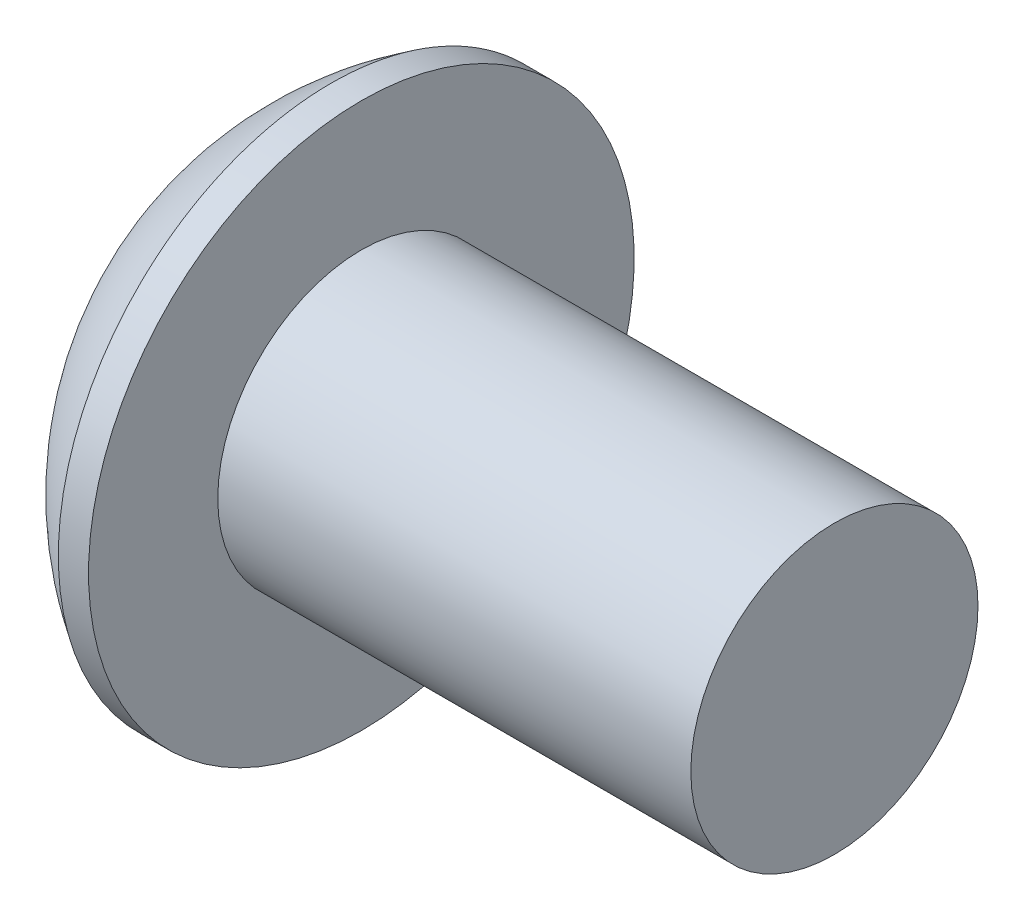
ISO-10303-21;
HEADER;
FILE_DESCRIPTION(('STEP AP214'),'2;1');
FILE_NAME('part.step','',(''),(''),'','','');
FILE_SCHEMA(('AUTOMOTIVE_DESIGN { 1 0 10303 214 1 1 1 1 }'));
ENDSEC;
DATA;
#1=APPLICATION_CONTEXT('core data for automotive mechanical design processes');
#2=APPLICATION_PROTOCOL_DEFINITION('international standard','automotive_design',2000,#1);
#3=PRODUCT_CONTEXT('',#1,'mechanical');
#4=PRODUCT('Part','Part','',(#3));
#5=PRODUCT_RELATED_PRODUCT_CATEGORY('part','',(#4));
#6=PRODUCT_DEFINITION_FORMATION('','',#4);
#7=PRODUCT_DEFINITION_CONTEXT('part definition',#1,'design');
#8=PRODUCT_DEFINITION('design','',#6,#7);
#9=PRODUCT_DEFINITION_SHAPE('','',#8);
#10=(LENGTH_UNIT() NAMED_UNIT(*) SI_UNIT(.MILLI.,.METRE.));
#11=(NAMED_UNIT(*) PLANE_ANGLE_UNIT() SI_UNIT($,.RADIAN.));
#12=(NAMED_UNIT(*) SI_UNIT($,.STERADIAN.) SOLID_ANGLE_UNIT());
#13=UNCERTAINTY_MEASURE_WITH_UNIT(LENGTH_MEASURE(1.E-05),#10,'distance_accuracy_value','');
#14=(GEOMETRIC_REPRESENTATION_CONTEXT(3) GLOBAL_UNCERTAINTY_ASSIGNED_CONTEXT((#13)) GLOBAL_UNIT_ASSIGNED_CONTEXT((#10,
#11,#12)) REPRESENTATION_CONTEXT('',''));
#15=CARTESIAN_POINT('',(0.,0.,0.));
#16=DIRECTION('',(0.,0.,1.));
#17=DIRECTION('',(1.,0.,0.));
#18=AXIS2_PLACEMENT_3D('',#15,#16,#17);
#19=CARTESIAN_POINT('',(-0.533400000000002,0.,0.));
#20=DIRECTION('',(-1.,0.,0.));
#21=DIRECTION('',(0.,0.,1.));
#22=AXIS2_PLACEMENT_3D('',#19,#20,#21);
#23=PLANE('',#22);
#24=DIRECTION('',(0.,0.5,0.866025403784439));
#25=VECTOR('',#24,1.);
#26=CARTESIAN_POINT('',(-0.533400000000002,1.83308710467706,0.));
#27=LINE('',#26,#25);
#28=CARTESIAN_POINT('',(-0.533400000000002,1.83308710467706,0.));
#29=VERTEX_POINT('',#28);
#30=CARTESIAN_POINT('',(-0.533400000000002,0.916543552338531,-1.5875));
#31=VERTEX_POINT('',#30);
#32=EDGE_CURVE('E115',#29,#31,#27,.F.);
#33=ORIENTED_EDGE('',*,*,#32,.T.);
#34=DIRECTION('',(0.,1.,0.));
#35=VECTOR('',#34,1.);
#36=CARTESIAN_POINT('',(-0.533400000000002,0.916543552338531,-1.5875));
#37=LINE('',#36,#35);
#38=CARTESIAN_POINT('',(-0.533400000000002,-0.916543552338531,-1.5875));
#39=VERTEX_POINT('',#38);
#40=EDGE_CURVE('E82',#31,#39,#37,.F.);
#41=ORIENTED_EDGE('',*,*,#40,.T.);
#42=DIRECTION('',(0.,0.5,-0.866025403784439));
#43=VECTOR('',#42,1.);
#44=CARTESIAN_POINT('',(-0.533400000000002,-0.916543552338531,-1.5875));
#45=LINE('',#44,#43);
#46=CARTESIAN_POINT('',(-0.533400000000002,-1.83308710467706,0.));
#47=VERTEX_POINT('',#46);
#48=EDGE_CURVE('E84',#39,#47,#45,.F.);
#49=ORIENTED_EDGE('',*,*,#48,.T.);
#50=DIRECTION('',(0.,-0.5,-0.866025403784439));
#51=VECTOR('',#50,1.);
#52=CARTESIAN_POINT('',(-0.533400000000002,-1.83308710467706,0.));
#53=LINE('',#52,#51);
#54=CARTESIAN_POINT('',(-0.533400000000002,-0.916543552338533,1.5875));
#55=VERTEX_POINT('',#54);
#56=EDGE_CURVE('E85',#47,#55,#53,.F.);
#57=ORIENTED_EDGE('',*,*,#56,.T.);
#58=DIRECTION('',(0.,-1.,0.));
#59=VECTOR('',#58,1.);
#60=CARTESIAN_POINT('',(-0.533400000000002,-0.916543552338532,1.5875));
#61=LINE('',#60,#59);
#62=CARTESIAN_POINT('',(-0.533400000000002,0.916543552338531,1.5875));
#63=VERTEX_POINT('',#62);
#64=EDGE_CURVE('E71',#55,#63,#61,.F.);
#65=ORIENTED_EDGE('',*,*,#64,.T.);
#66=DIRECTION('',(0.,-0.5,0.866025403784439));
#67=VECTOR('',#66,1.);
#68=CARTESIAN_POINT('',(-0.533400000000002,0.916543552338531,1.5875));
#69=LINE('',#68,#67);
#70=EDGE_CURVE('E110',#63,#29,#69,.F.);
#71=ORIENTED_EDGE('',*,*,#70,.T.);
#72=EDGE_LOOP('',(#33,#41,#49,#57,#65,#71));
#73=FACE_BOUND('',#72,.T.);
#74=ADVANCED_FACE('F17',(#73),#23,.T.);
#75=CARTESIAN_POINT('',(-0.533400000000002,-1.83308710467706,0.));
#76=DIRECTION('',(0.,-0.866025403784439,0.5));
#77=DIRECTION('',(0.,-0.5,-0.866025403784439));
#78=AXIS2_PLACEMENT_3D('',#75,#76,#77);
#79=PLANE('',#78);
#80=CARTESIAN_POINT('',(-2.56539999994394,-1.8330871046745,-2.00804498786736E-11));
#81=CARTESIAN_POINT('',(-2.53392818229741,-1.80158505518366,0.0545631502562923));
#82=CARTESIAN_POINT('',(-2.5043050627177,-1.76955629074211,0.110038597579172));
#83=CARTESIAN_POINT('',(-2.45006639539122,-1.70424635317817,0.223158727683824));
#84=CARTESIAN_POINT('',(-2.42548101615987,-1.6709589724711,0.280814162317604));
#85=CARTESIAN_POINT('',(-2.38336609605347,-1.60383660211837,0.397073518091736));
#86=CARTESIAN_POINT('',(-2.36573072948629,-1.57001869730198,0.455647847439699));
#87=CARTESIAN_POINT('',(-2.33856008862263,-1.50163859306838,0.574085662199493));
#88=CARTESIAN_POINT('',(-2.32900454007239,-1.46707848106388,0.633945532106421));
#89=CARTESIAN_POINT('',(-2.32038274183869,-1.40751253669323,0.737116774157155));
#90=CARTESIAN_POINT('',(-2.31910682172836,-1.38258360390154,0.780294952330845));
#91=CARTESIAN_POINT('',(-2.32125913780735,-1.33276652395073,0.866580665890379));
#92=CARTESIAN_POINT('',(-2.32468902284537,-1.30787839414808,0.90968817121394));
#93=CARTESIAN_POINT('',(-2.33605631415915,-1.25834345643267,0.995485200086784));
#94=CARTESIAN_POINT('',(-2.34399762019329,-1.23369687609494,1.03817432946455));
#95=CARTESIAN_POINT('',(-2.36395627681902,-1.18481740842653,1.12283605091316));
#96=CARTESIAN_POINT('',(-2.37597537628367,-1.16058470328902,1.16480832741616));
#97=CARTESIAN_POINT('',(-2.41164383187845,-1.09853862948576,1.27227527965358));
#98=CARTESIAN_POINT('',(-2.43797770752625,-1.06110942924036,1.33710455616529));
#99=CARTESIAN_POINT('',(-2.48243061452926,-1.00607390269188,1.43242888436855));
#100=CARTESIAN_POINT('',(-2.49804835924321,-0.987937988038022,1.46384120999077));
#101=CARTESIAN_POINT('',(-2.53070945051393,-0.951999508520197,1.52608848246242));
#102=CARTESIAN_POINT('',(-2.54775211871235,-0.934196789917587,1.55692369559499));
#103=CARTESIAN_POINT('',(-2.56539999993807,-0.916543552329633,1.58750000001541));
#104=B_SPLINE_CURVE_WITH_KNOTS('',3,(#80,#81,#82,#83,#84,#85,#86,#87,#88,#89,#90,#91,#92,#93,
#94,#95,#96,#97,#98,#99,#100,#101,#102,#103),.UNSPECIFIED.,.F.,.F.,(4,2,2,2,2,2,2,2,2,2,2,4),
(0.,0.211427927732169,0.424087197148228,0.633370156422424,0.842126401515785,0.991537201098734,
1.14100036552056,1.29059292577265,1.44024972414947,1.67781721417335,1.79627069411587,
1.91466809995991),.UNSPECIFIED.);
#105=CARTESIAN_POINT('',(-2.56539999993857,-1.83308710468646,0.));
#106=VERTEX_POINT('',#105);
#107=CARTESIAN_POINT('',(-2.56539999993106,-0.916543552342318,1.5875));
#108=VERTEX_POINT('',#107);
#109=EDGE_CURVE('E20',#106,#108,#104,.T.);
#110=ORIENTED_EDGE('',*,*,#109,.T.);
#111=DIRECTION('',(1.,0.,0.));
#112=VECTOR('',#111,1.);
#113=CARTESIAN_POINT('',(-0.533400000000002,-0.916543552338533,1.5875));
#114=LINE('',#113,#112);
#115=EDGE_CURVE('E90',#108,#55,#114,.T.);
#116=ORIENTED_EDGE('',*,*,#115,.T.);
#117=ORIENTED_EDGE('',*,*,#56,.F.);
#118=DIRECTION('',(1.,0.,0.));
#119=VECTOR('',#118,1.);
#120=CARTESIAN_POINT('',(-0.533400000000002,-1.83308710467706,0.));
#121=LINE('',#120,#119);
#122=EDGE_CURVE('E58',#47,#106,#121,.F.);
#123=ORIENTED_EDGE('',*,*,#122,.T.);
#124=EDGE_LOOP('',(#110,#116,#117,#123));
#125=FACE_BOUND('',#124,.T.);
#126=ADVANCED_FACE('F89',(#125),#79,.F.);
#127=CARTESIAN_POINT('',(-0.533400000000002,-0.916543552338531,-1.5875));
#128=DIRECTION('',(0.,-0.866025403784439,-0.5));
#129=DIRECTION('',(0.,0.5,-0.866025403784439));
#130=AXIS2_PLACEMENT_3D('',#127,#128,#129);
#131=PLANE('',#130);
#132=CARTESIAN_POINT('',(-2.56539999994527,-0.916543552319403,-1.58750000001409));
#133=CARTESIAN_POINT('',(-2.53392818229919,-0.948045601822691,-1.53293684974403));
#134=CARTESIAN_POINT('',(-2.50430506271949,-0.980074366269487,-1.47746140242354));
#135=CARTESIAN_POINT('',(-2.45006639539264,-1.04538430383757,-1.36434127232016));
#136=CARTESIAN_POINT('',(-2.42548101616093,-1.07867168454351,-1.30668583768523));
#137=CARTESIAN_POINT('',(-2.38336609605398,-1.14579405489574,-1.19042648190974));
#138=CARTESIAN_POINT('',(-2.36573072948662,-1.17961195971273,-1.13185215256154));
#139=CARTESIAN_POINT('',(-2.3385600886227,-1.2479920639471,-1.013414337801));
#140=CARTESIAN_POINT('',(-2.32900454007237,-1.28255217595175,-0.953554467893575));
#141=CARTESIAN_POINT('',(-2.32038274183866,-1.34211812032265,-0.850383225842316));
#142=CARTESIAN_POINT('',(-2.31910682172835,-1.36704705311438,-0.807205047668587));
#143=CARTESIAN_POINT('',(-2.32125913780739,-1.41686413306525,-0.720919334108961));
#144=CARTESIAN_POINT('',(-2.32468902284544,-1.44175226286793,-0.67781182878535));
#145=CARTESIAN_POINT('',(-2.33605631415929,-1.49128720058339,-0.592014799912417));
#146=CARTESIAN_POINT('',(-2.34399762019345,-1.51593378092113,-0.54932567053461));
#147=CARTESIAN_POINT('',(-2.36395627681926,-1.56481324858959,-0.464663949085931));
#148=CARTESIAN_POINT('',(-2.37597537628395,-1.58904595372712,-0.422691672582891));
#149=CARTESIAN_POINT('',(-2.41164383187876,-1.65109202753029,-0.315224720345625));
#150=CARTESIAN_POINT('',(-2.43797770752652,-1.6885212277756,-0.250395443834082));
#151=CARTESIAN_POINT('',(-2.48243061452944,-1.74355675432393,-0.15507111563107));
#152=CARTESIAN_POINT('',(-2.49804835924337,-1.76169266897775,-0.123658790008927));
#153=CARTESIAN_POINT('',(-2.53070945051401,-1.79763114849548,-0.0614115175374324));
#154=CARTESIAN_POINT('',(-2.5477521187124,-1.81543386709805,-0.0305763044049344));
#155=CARTESIAN_POINT('',(-2.56539999993807,-1.83308710468596,1.54136844652939E-11));
#156=B_SPLINE_CURVE_WITH_KNOTS('',3,(#132,#133,#134,#135,#136,#137,#138,#139,#140,#141,#142,
#143,#144,#145,#146,#147,#148,#149,#150,#151,#152,#153,#154,#155),.UNSPECIFIED.,.F.,.F.,(4,2,2,
2,2,2,2,2,2,2,2,4),(0.,0.211427927733669,0.424087197151313,0.633370156427101,0.842126401522016,
0.99153720110513,1.14100036552713,1.29059292577937,1.44024972415633,1.67781721417961,
1.79627069412184,1.9146680999656),.UNSPECIFIED.);
#157=CARTESIAN_POINT('',(-2.56539999995198,-0.916543552351339,-1.58750000002218));
#158=VERTEX_POINT('',#157);
#159=EDGE_CURVE('E94',#158,#106,#156,.T.);
#160=ORIENTED_EDGE('',*,*,#159,.T.);
#161=ORIENTED_EDGE('',*,*,#122,.F.);
#162=ORIENTED_EDGE('',*,*,#48,.F.);
#163=DIRECTION('',(-1.,0.,0.));
#164=VECTOR('',#163,1.);
#165=CARTESIAN_POINT('',(-0.533400000000002,-0.916543552338531,-1.5875));
#166=LINE('',#165,#164);
#167=EDGE_CURVE('E96',#39,#158,#166,.T.);
#168=ORIENTED_EDGE('',*,*,#167,.T.);
#169=EDGE_LOOP('',(#160,#161,#162,#168));
#170=FACE_BOUND('',#169,.T.);
#171=ADVANCED_FACE('F92',(#170),#131,.F.);
#172=CARTESIAN_POINT('',(-0.533400000000002,0.916543552338531,-1.5875));
#173=DIRECTION('',(0.,0.,-1.));
#174=DIRECTION('',(-1.,0.,0.));
#175=AXIS2_PLACEMENT_3D('',#172,#173,#174);
#176=PLANE('',#175);
#177=CARTESIAN_POINT('',(-2.56539999994527,0.916543552360294,-1.58749999999048));
#178=CARTESIAN_POINT('',(-2.53392818229821,0.853539453376781,-1.58749999999657));
#179=CARTESIAN_POINT('',(-2.50430506271702,0.789481924500113,-1.58749999999908));
#180=CARTESIAN_POINT('',(-2.45006639538581,0.658862049392287,-1.58750000000093));
#181=CARTESIAN_POINT('',(-2.42548101615122,0.59228728799181,-1.58750000000025));
#182=CARTESIAN_POINT('',(-2.38336609603683,0.458042547310979,-1.58749999999976));
#183=CARTESIAN_POINT('',(-2.36573072946494,0.390406737689213,-1.58749999999994));
#184=CARTESIAN_POINT('',(-2.3385600885904,0.253646529243895,-1.58750000000006));
#185=CARTESIAN_POINT('',(-2.32900454003397,0.184526305245804,-1.58750000000001));
#186=CARTESIAN_POINT('',(-2.32038274178942,0.0653944165301613,-1.58749999999999));
#187=CARTESIAN_POINT('',(-2.31910682167392,0.0155365509618711,-1.5875));
#188=CARTESIAN_POINT('',(-2.3212591377409,-0.0840976089101244,-1.5875));
#189=CARTESIAN_POINT('',(-2.32468902277208,-0.133873868500894,-1.5875));
#190=CARTESIAN_POINT('',(-2.33605631407098,-0.2329437439033,-1.5875));
#191=CARTESIAN_POINT('',(-2.34399762009707,-0.282236904564879,-1.5875));
#192=CARTESIAN_POINT('',(-2.36395627670599,-0.379995839874564,-1.5875));
#193=CARTESIAN_POINT('',(-2.37597537616188,-0.428461250136325,-1.5875));
#194=CARTESIAN_POINT('',(-2.41164383175616,-0.552553397787632,-1.5875));
#195=CARTESIAN_POINT('',(-2.43797770742117,-0.627411798334259,-1.5875));
#196=CARTESIAN_POINT('',(-2.48243061445881,-0.737482851511091,-1.5875));
#197=CARTESIAN_POINT('',(-2.49804835918582,-0.773754680844889,-1.5875));
#198=CARTESIAN_POINT('',(-2.53070945048496,-0.845631639931401,-1.5875));
#199=CARTESIAN_POINT('',(-2.54775211869874,-0.881237077161412,-1.5875));
#200=CARTESIAN_POINT('',(-2.56539999994071,-0.916543552361606,-1.5875));
#201=B_SPLINE_CURVE_WITH_KNOTS('',3,(#177,#178,#179,#180,#181,#182,#183,#184,#185,#186,#187,
#188,#189,#190,#191,#192,#193,#194,#195,#196,#197,#198,#199,#200),.UNSPECIFIED.,.F.,.F.,(4,2,2,
2,2,2,2,2,2,2,2,4),(0.,0.211427927701375,0.424087197086717,0.633370156331471,0.842126401395377,
0.991537200933545,1.14100036531054,1.29059292551773,1.44024972384963,1.677817214047,
1.79627069407681,1.91466810000777),.UNSPECIFIED.);
#202=CARTESIAN_POINT('',(-2.56539999995198,0.916543552337129,-1.58749999999757));
#203=VERTEX_POINT('',#202);
#204=EDGE_CURVE('E198',#203,#158,#201,.T.);
#205=ORIENTED_EDGE('',*,*,#204,.T.);
#206=ORIENTED_EDGE('',*,*,#167,.F.);
#207=ORIENTED_EDGE('',*,*,#40,.F.);
#208=DIRECTION('',(1.,0.,0.));
#209=VECTOR('',#208,1.);
#210=CARTESIAN_POINT('',(-0.533400000000002,0.916543552338531,-1.5875));
#211=LINE('',#210,#209);
#212=EDGE_CURVE('E112',#31,#203,#211,.F.);
#213=ORIENTED_EDGE('',*,*,#212,.T.);
#214=EDGE_LOOP('',(#205,#206,#207,#213));
#215=FACE_BOUND('',#214,.T.);
#216=ADVANCED_FACE('F188',(#215),#176,.F.);
#217=CARTESIAN_POINT('',(-0.533400000000002,1.83308710467706,0.));
#218=DIRECTION('',(0.,0.866025403784439,-0.5));
#219=DIRECTION('',(0.,0.5,0.866025403784439));
#220=AXIS2_PLACEMENT_3D('',#217,#218,#219);
#221=PLANE('',#220);
#222=CARTESIAN_POINT('',(-2.56539999994394,1.8330871046745,2.00800374309997E-11));
#223=CARTESIAN_POINT('',(-2.5339281822974,1.80158505518366,-0.0545631502562965));
#224=CARTESIAN_POINT('',(-2.5043050627177,1.76955629074211,-0.11003859757918));
#225=CARTESIAN_POINT('',(-2.45006639539121,1.70424635317816,-0.22315872768384));
#226=CARTESIAN_POINT('',(-2.42548101615987,1.67095897247109,-0.280814162317626));
#227=CARTESIAN_POINT('',(-2.38336609605347,1.60383660211835,-0.397073518091758));
#228=CARTESIAN_POINT('',(-2.36573072948628,1.57001869730197,-0.455647847439717));
#229=CARTESIAN_POINT('',(-2.33856008862263,1.50163859306837,-0.574085662199503));
#230=CARTESIAN_POINT('',(-2.32900454007239,1.46707848106388,-0.633945532106426));
#231=CARTESIAN_POINT('',(-2.32038274183869,1.40751253669322,-0.737116774157154));
#232=CARTESIAN_POINT('',(-2.31910682172836,1.38258360390154,-0.780294952330843));
#233=CARTESIAN_POINT('',(-2.32125913780735,1.33276652395073,-0.866580665890374));
#234=CARTESIAN_POINT('',(-2.32468902284537,1.30787839414808,-0.909688171213933));
#235=CARTESIAN_POINT('',(-2.33605631415915,1.25834345643267,-0.995485200086777));
#236=CARTESIAN_POINT('',(-2.34399762019328,1.23369687609495,-1.03817432946455));
#237=CARTESIAN_POINT('',(-2.36395627681902,1.18481740842653,-1.12283605091316));
#238=CARTESIAN_POINT('',(-2.37597537628367,1.16058470328902,-1.16480832741616));
#239=CARTESIAN_POINT('',(-2.41164383187872,1.09853862948529,-1.2722752796544));
#240=CARTESIAN_POINT('',(-2.43797770752691,1.06110942923942,-1.33710455616691));
#241=CARTESIAN_POINT('',(-2.48243061453059,1.00607390269029,-1.43242888437131));
#242=CARTESIAN_POINT('',(-2.49804835924479,0.987937988036214,-1.4638412099939));
#243=CARTESIAN_POINT('',(-2.53070945051602,0.951999508517968,-1.52608848246628));
#244=CARTESIAN_POINT('',(-2.54775211871471,0.934196789915152,-1.55692369559921));
#245=CARTESIAN_POINT('',(-2.56539999994071,0.916543552326994,-1.58750000001998));
#246=B_SPLINE_CURVE_WITH_KNOTS('',3,(#222,#223,#224,#225,#226,#227,#228,#229,#230,#231,#232,
#233,#234,#235,#236,#237,#238,#239,#240,#241,#242,#243,#244,#245),.UNSPECIFIED.,.F.,.F.,(4,2,2,
2,2,2,2,2,2,2,2,4),(0.,0.211427927732185,0.424087197148259,0.63337015642244,0.842126401515786,
0.99153720109873,1.14100036552055,1.29059292577265,1.44024972414947,1.67781721417631,
1.7962706941203,1.9146680999658),.UNSPECIFIED.);
#247=CARTESIAN_POINT('',(-2.56539999993857,1.83308710468646,0.));
#248=VERTEX_POINT('',#247);
#249=EDGE_CURVE('E192',#248,#203,#246,.T.);
#250=ORIENTED_EDGE('',*,*,#249,.T.);
#251=ORIENTED_EDGE('',*,*,#212,.F.);
#252=ORIENTED_EDGE('',*,*,#32,.F.);
#253=DIRECTION('',(1.,0.,0.));
#254=VECTOR('',#253,1.);
#255=CARTESIAN_POINT('',(-0.533400000000002,1.83308710467706,0.));
#256=LINE('',#255,#254);
#257=EDGE_CURVE('E107',#29,#248,#256,.F.);
#258=ORIENTED_EDGE('',*,*,#257,.T.);
#259=EDGE_LOOP('',(#250,#251,#252,#258));
#260=FACE_BOUND('',#259,.T.);
#261=ADVANCED_FACE('F184',(#260),#221,.F.);
#262=CARTESIAN_POINT('',(-0.533400000000002,0.916543552338531,1.5875));
#263=DIRECTION('',(0.,0.866025403784439,0.5));
#264=DIRECTION('',(0.,-0.5,0.866025403784439));
#265=AXIS2_PLACEMENT_3D('',#262,#263,#264);
#266=PLANE('',#265);
#267=CARTESIAN_POINT('',(-2.56539999994394,0.91654355231986,1.58750000000782));
#268=CARTESIAN_POINT('',(-2.53392818229741,0.948045601824288,1.5329368497393));
#269=CARTESIAN_POINT('',(-2.5043050627177,0.980074366271431,1.47746140241964));
#270=CARTESIAN_POINT('',(-2.45006639539122,1.04538430383949,1.36434127231737));
#271=CARTESIAN_POINT('',(-2.42548101615987,1.07867168454504,1.30668583768271));
#272=CARTESIAN_POINT('',(-2.38336609605347,1.14579405489669,1.19042648190795));
#273=CARTESIAN_POINT('',(-2.36573072948629,1.17961195971347,1.13185215256022));
#274=CARTESIAN_POINT('',(-2.33856008862263,1.24799206394736,1.01341433780059));
#275=CARTESIAN_POINT('',(-2.32900454007239,1.28255217595174,0.953554467893597));
#276=CARTESIAN_POINT('',(-2.32038274183869,1.34211812032234,0.850383225842832));
#277=CARTESIAN_POINT('',(-2.31910682172836,1.36704705311405,0.807205047669152));
#278=CARTESIAN_POINT('',(-2.32125913780735,1.41686413306487,0.720919334109624));
#279=CARTESIAN_POINT('',(-2.32468902284537,1.44175226286752,0.677811828786061));
#280=CARTESIAN_POINT('',(-2.33605631415915,1.49128720058292,0.592014799913215));
#281=CARTESIAN_POINT('',(-2.34399762019328,1.51593378092065,0.549325670535446));
#282=CARTESIAN_POINT('',(-2.36395627681902,1.56481324858906,0.464663949086841));
#283=CARTESIAN_POINT('',(-2.37597537628367,1.58904595372657,0.422691672583837));
#284=CARTESIAN_POINT('',(-2.41164383187845,1.65109202752983,0.315224720346425));
#285=CARTESIAN_POINT('',(-2.43797770752625,1.68852122777524,0.250395443834706));
#286=CARTESIAN_POINT('',(-2.48243061452926,1.74355675432371,0.155071115631445));
#287=CARTESIAN_POINT('',(-2.49804835924321,1.76169266897757,0.123658790009225));
#288=CARTESIAN_POINT('',(-2.53070945051393,1.7976311484954,0.0614115175375789));
#289=CARTESIAN_POINT('',(-2.54775211871235,1.81543386709801,0.0305763044050067));
#290=CARTESIAN_POINT('',(-2.56539999993807,1.83308710468596,-1.54142580803093E-11));
#291=B_SPLINE_CURVE_WITH_KNOTS('',3,(#267,#268,#269,#270,#271,#272,#273,#274,#275,#276,#277,
#278,#279,#280,#281,#282,#283,#284,#285,#286,#287,#288,#289,#290),.UNSPECIFIED.,.F.,.F.,(4,2,2,
2,2,2,2,2,2,2,2,4),(0.,0.211427927732169,0.424087197148227,0.633370156422423,0.842126401515785,
0.991537201098733,1.14100036552056,1.29059292577265,1.44024972414946,1.67781721417335,
1.79627069411587,1.91466809995991),.UNSPECIFIED.);
#292=CARTESIAN_POINT('',(-2.56539999993857,0.91654355234323,1.58750000000814));
#293=VERTEX_POINT('',#292);
#294=EDGE_CURVE('E166',#293,#248,#291,.T.);
#295=ORIENTED_EDGE('',*,*,#294,.T.);
#296=ORIENTED_EDGE('',*,*,#257,.F.);
#297=ORIENTED_EDGE('',*,*,#70,.F.);
#298=DIRECTION('',(1.,0.,0.));
#299=VECTOR('',#298,1.);
#300=CARTESIAN_POINT('',(-0.533400000000002,0.916543552338531,1.5875));
#301=LINE('',#300,#299);
#302=EDGE_CURVE('E39',#63,#293,#301,.F.);
#303=ORIENTED_EDGE('',*,*,#302,.T.);
#304=EDGE_LOOP('',(#295,#296,#297,#303));
#305=FACE_BOUND('',#304,.T.);
#306=ADVANCED_FACE('F177',(#305),#266,.F.);
#307=CARTESIAN_POINT('',(-0.533400000000002,-0.916543552338532,1.5875));
#308=DIRECTION('',(0.,0.,1.));
#309=DIRECTION('',(0.,-1.,0.));
#310=AXIS2_PLACEMENT_3D('',#307,#308,#309);
#311=PLANE('',#310);
#312=CARTESIAN_POINT('',(-2.56539999994394,-0.916543552354642,1.58749999998774));
#313=CARTESIAN_POINT('',(-2.53392818229741,-0.853539453359365,1.58749999999559));
#314=CARTESIAN_POINT('',(-2.50430506271771,-0.789481924470656,1.58749999999882));
#315=CARTESIAN_POINT('',(-2.45006639539122,-0.658862049338629,1.58750000000119));
#316=CARTESIAN_POINT('',(-2.42548101615988,-0.592287287925995,1.58750000000032));
#317=CARTESIAN_POINT('',(-2.38336609605349,-0.458042547221593,1.58749999999969));
#318=CARTESIAN_POINT('',(-2.36573072948631,-0.390406737588416,1.58749999999992));
#319=CARTESIAN_POINT('',(-2.33856008862266,-0.253646529120892,1.58750000000008));
#320=CARTESIAN_POINT('',(-2.32900454007243,-0.184526305112002,1.58750000000002));
#321=CARTESIAN_POINT('',(-2.32038274183874,-0.065394416370719,1.58749999999999));
#322=CARTESIAN_POINT('',(-2.31910682172841,-0.0155365507873145,1.5875));
#323=CARTESIAN_POINT('',(-2.32125913780742,0.0840976091143436,1.5875));
#324=CARTESIAN_POINT('',(-2.32468902284545,0.133873868719661,1.5875));
#325=CARTESIAN_POINT('',(-2.33605631415924,0.232943744150505,1.5875));
#326=CARTESIAN_POINT('',(-2.34399762019338,0.282236904825971,1.5875));
#327=CARTESIAN_POINT('',(-2.36395627681913,0.379995840162817,1.5875));
#328=CARTESIAN_POINT('',(-2.37597537628379,0.428461250437852,1.5875));
#329=CARTESIAN_POINT('',(-2.41164383187857,0.552553398044325,1.5875));
#330=CARTESIAN_POINT('',(-2.43797770752636,0.627411798535089,1.5875));
#331=CARTESIAN_POINT('',(-2.48243061452933,0.737482851631955,1.5875));
#332=CARTESIAN_POINT('',(-2.49804835924327,0.773754680939651,1.5875));
#333=CARTESIAN_POINT('',(-2.53070945051396,0.84563163997525,1.5875));
#334=CARTESIAN_POINT('',(-2.54775211871237,0.881237077180446,1.5875));
#335=CARTESIAN_POINT('',(-2.56539999993807,0.91654355235633,1.5875));
#336=B_SPLINE_CURVE_WITH_KNOTS('',3,(#312,#313,#314,#315,#316,#317,#318,#319,#320,#321,#322,
#323,#324,#325,#326,#327,#328,#329,#330,#331,#332,#333,#334,#335),.UNSPECIFIED.,.F.,.F.,(4,2,2,
2,2,2,2,2,2,2,2,4),(0.,0.211427927732202,0.424087197148294,0.633370156422521,0.842126401515914,
0.991537201098908,1.14100036552078,1.29059292577292,1.44024972414978,1.67781721417349,
1.79627069411592,1.91466809995988),.UNSPECIFIED.);
#337=EDGE_CURVE('E158',#108,#293,#336,.T.);
#338=ORIENTED_EDGE('',*,*,#337,.T.);
#339=ORIENTED_EDGE('',*,*,#302,.F.);
#340=ORIENTED_EDGE('',*,*,#64,.F.);
#341=ORIENTED_EDGE('',*,*,#115,.F.);
#342=EDGE_LOOP('',(#338,#339,#340,#341));
#343=FACE_BOUND('',#342,.T.);
#344=ADVANCED_FACE('F173',(#343),#311,.F.);
#345=CARTESIAN_POINT('',(-2.56540000003724,0.,0.));
#346=DIRECTION('',(-1.,0.,0.));
#347=DIRECTION('',(0.,-1.,0.));
#348=AXIS2_PLACEMENT_3D('',#345,#346,#347);
#349=CONICAL_SURFACE('',#348,1.83308710478514,0.78539816351237);
#350=ORIENTED_EDGE('',*,*,#109,.F.);
#351=CARTESIAN_POINT('',(-2.56539999992356,0.,0.));
#352=DIRECTION('',(-1.,0.,0.));
#353=DIRECTION('',(0.,-1.,0.));
#354=AXIS2_PLACEMENT_3D('',#351,#352,#353);
#355=CIRCLE('',#354,1.83308710467145);
#356=EDGE_CURVE('E165',#108,#106,#355,.F.);
#357=ORIENTED_EDGE('',*,*,#356,.F.);
#358=EDGE_LOOP('',(#350,#357));
#359=FACE_BOUND('',#358,.T.);
#360=ADVANCED_FACE('F176',(#359),#349,.F.);
#361=CARTESIAN_POINT('',(-2.56540000003724,0.,0.));
#362=DIRECTION('',(-1.,0.,0.));
#363=DIRECTION('',(0.,-1.,0.));
#364=AXIS2_PLACEMENT_3D('',#361,#362,#363);
#365=CONICAL_SURFACE('',#364,1.83308710478514,0.78539816351237);
#366=ORIENTED_EDGE('',*,*,#159,.F.);
#367=CARTESIAN_POINT('',(-2.56539999992356,0.,0.));
#368=DIRECTION('',(-1.,0.,0.));
#369=DIRECTION('',(0.,-1.,0.));
#370=AXIS2_PLACEMENT_3D('',#367,#368,#369);
#371=CIRCLE('',#370,1.83308710467145);
#372=EDGE_CURVE('E272',#106,#158,#371,.F.);
#373=ORIENTED_EDGE('',*,*,#372,.F.);
#374=EDGE_LOOP('',(#366,#373));
#375=FACE_BOUND('',#374,.T.);
#376=ADVANCED_FACE('F210',(#375),#365,.F.);
#377=CARTESIAN_POINT('',(-2.56540000003724,0.,0.));
#378=DIRECTION('',(-1.,0.,0.));
#379=DIRECTION('',(0.,-1.,0.));
#380=AXIS2_PLACEMENT_3D('',#377,#378,#379);
#381=CONICAL_SURFACE('',#380,1.83308710478514,0.785398163397448);
#382=ORIENTED_EDGE('',*,*,#204,.F.);
#383=CARTESIAN_POINT('',(-2.5653999999804,0.,0.));
#384=DIRECTION('',(-1.,0.,0.));
#385=DIRECTION('',(0.,-1.,0.));
#386=AXIS2_PLACEMENT_3D('',#383,#384,#385);
#387=CIRCLE('',#386,1.83308710472829);
#388=EDGE_CURVE('E269',#158,#203,#387,.F.);
#389=ORIENTED_EDGE('',*,*,#388,.F.);
#390=EDGE_LOOP('',(#382,#389));
#391=FACE_BOUND('',#390,.T.);
#392=ADVANCED_FACE('F206',(#391),#381,.F.);
#393=CARTESIAN_POINT('',(-2.56540000003724,0.,0.));
#394=DIRECTION('',(-1.,0.,0.));
#395=DIRECTION('',(0.,-1.,0.));
#396=AXIS2_PLACEMENT_3D('',#393,#394,#395);
#397=CONICAL_SURFACE('',#396,1.83308710478514,0.78539816351237);
#398=ORIENTED_EDGE('',*,*,#249,.F.);
#399=CARTESIAN_POINT('',(-2.56539999992356,0.,0.));
#400=DIRECTION('',(-1.,0.,0.));
#401=DIRECTION('',(0.,-1.,0.));
#402=AXIS2_PLACEMENT_3D('',#399,#400,#401);
#403=CIRCLE('',#402,1.83308710467145);
#404=EDGE_CURVE('E266',#203,#248,#403,.F.);
#405=ORIENTED_EDGE('',*,*,#404,.F.);
#406=EDGE_LOOP('',(#398,#405));
#407=FACE_BOUND('',#406,.T.);
#408=ADVANCED_FACE('F203',(#407),#397,.F.);
#409=CARTESIAN_POINT('',(-2.56540000003724,0.,0.));
#410=DIRECTION('',(-1.,0.,0.));
#411=DIRECTION('',(0.,-1.,0.));
#412=AXIS2_PLACEMENT_3D('',#409,#410,#411);
#413=CONICAL_SURFACE('',#412,1.83308710478514,0.78539816351237);
#414=ORIENTED_EDGE('',*,*,#294,.F.);
#415=CARTESIAN_POINT('',(-2.56539999992356,0.,0.));
#416=DIRECTION('',(-1.,0.,0.));
#417=DIRECTION('',(0.,-1.,0.));
#418=AXIS2_PLACEMENT_3D('',#415,#416,#417);
#419=CIRCLE('',#418,1.83308710467145);
#420=EDGE_CURVE('E261',#248,#293,#419,.F.);
#421=ORIENTED_EDGE('',*,*,#420,.F.);
#422=EDGE_LOOP('',(#414,#421));
#423=FACE_BOUND('',#422,.T.);
#424=ADVANCED_FACE('F153',(#423),#413,.F.);
#425=CARTESIAN_POINT('',(-2.56540000003724,0.,0.));
#426=DIRECTION('',(-1.,0.,0.));
#427=DIRECTION('',(0.,-1.,0.));
#428=AXIS2_PLACEMENT_3D('',#425,#426,#427);
#429=CONICAL_SURFACE('',#428,1.83308710478514,0.785398163512485);
#430=ORIENTED_EDGE('',*,*,#337,.F.);
#431=CARTESIAN_POINT('',(-2.56539999992356,0.,0.));
#432=DIRECTION('',(-1.,0.,0.));
#433=DIRECTION('',(0.,-1.,0.));
#434=AXIS2_PLACEMENT_3D('',#431,#432,#433);
#435=CIRCLE('',#434,1.83308710467145);
#436=EDGE_CURVE('E138',#293,#108,#435,.F.);
#437=ORIENTED_EDGE('',*,*,#436,.F.);
#438=EDGE_LOOP('',(#430,#437));
#439=FACE_BOUND('',#438,.T.);
#440=ADVANCED_FACE('F148',(#439),#429,.F.);
#441=CARTESIAN_POINT('',(-2.5654,0.,0.));
#442=DIRECTION('',(-1.,0.,0.));
#443=DIRECTION('',(0.,-1.,0.));
#444=AXIS2_PLACEMENT_3D('',#441,#442,#443);
#445=PLANE('',#444);
#446=CARTESIAN_POINT('',(-2.5654,-2.29235000000002,0.));
#447=CARTESIAN_POINT('',(-2.56540000000001,-2.29234961429958,-0.0643619991867162));
#448=CARTESIAN_POINT('',(-2.56540000000002,-2.28963695190109,-0.128735826629366));
#449=CARTESIAN_POINT('',(-2.56539999999999,-2.27880393843649,-0.257038618985287));
#450=CARTESIAN_POINT('',(-2.56539999999995,-2.27068199085128,-0.320967446929163));
#451=CARTESIAN_POINT('',(-2.56540000000006,-2.24906694794257,-0.448021254607718));
#452=CARTESIAN_POINT('',(-2.56540000000021,-2.23556532653462,-0.511144793381861));
#453=CARTESIAN_POINT('',(-2.56539999999979,-2.20328400495645,-0.636065176149322));
#454=CARTESIAN_POINT('',(-2.56539999999921,-2.18450002159115,-0.697860899533935));
#455=CARTESIAN_POINT('',(-2.56539999999869,-2.12048422735804,-0.88032980292775));
#456=CARTESIAN_POINT('',(-2.56539999999995,-2.0675359907946,-0.99839179592812));
#457=CARTESIAN_POINT('',(-2.56540000000006,-1.94254204858674,-1.22393765942148));
#458=CARTESIAN_POINT('',(-2.56539999999891,-1.87049561696644,-1.33142112758208));
#459=CARTESIAN_POINT('',(-2.56539999999932,-1.74974254194881,-1.48237719670935));
#460=CARTESIAN_POINT('',(-2.56539999999982,-1.70734573132302,-1.53101280076738));
#461=CARTESIAN_POINT('',(-2.56540000000018,-1.6186391029153,-1.62450601319185));
#462=CARTESIAN_POINT('',(-2.56540000000005,-1.57233309727313,-1.66936721890417));
#463=CARTESIAN_POINT('',(-2.56539999999995,-1.47608431707234,-1.7550488420402));
#464=CARTESIAN_POINT('',(-2.56539999999999,-1.42613990458995,-1.79586741981512));
#465=CARTESIAN_POINT('',(-2.56540000000002,-1.32299452541252,-1.87315615311523));
#466=CARTESIAN_POINT('',(-2.56540000000001,-1.26979280714188,-1.90962529930697));
#467=CARTESIAN_POINT('',(-2.56539999999999,-1.10588180153953,-2.0120772215109));
#468=CARTESIAN_POINT('',(-2.5654,-0.990764947001321,-2.07119486286667));
#469=CARTESIAN_POINT('',(-2.5654,-0.752302198839727,-2.16922858468856));
#470=CARTESIAN_POINT('',(-2.5654,-0.628956393121269,-2.2081448809145));
#471=CARTESIAN_POINT('',(-2.5654,-0.377466101733277,-2.2647275576592));
#472=CARTESIAN_POINT('',(-2.5654,-0.249321590440388,-2.28239382469379));
#473=CARTESIAN_POINT('',(-2.5654,0.0081143537161001,-2.29595665980956));
#474=CARTESIAN_POINT('',(-2.5654,0.137405786579698,-2.29185322789073));
#475=CARTESIAN_POINT('',(-2.5654,0.393449386933719,-2.2620096240906));
#476=CARTESIAN_POINT('',(-2.5654,0.520201567981077,-2.23626956775766));
#477=CARTESIAN_POINT('',(-2.5654,0.767645294384444,-2.16383549332687));
#478=CARTESIAN_POINT('',(-2.5654,0.888336774993549,-2.11714125142686));
#479=CARTESIAN_POINT('',(-2.5654,1.06210572146655,-2.03247976453654));
#480=CARTESIAN_POINT('',(-2.5654,1.11884498714066,-2.00180278323696));
#481=CARTESIAN_POINT('',(-2.5654,1.22954062855572,-1.93578011658036));
#482=CARTESIAN_POINT('',(-2.5654,1.28349764565392,-1.9004355139425));
#483=CARTESIAN_POINT('',(-2.5654,1.38821676641537,-1.82534174602348));
#484=CARTESIAN_POINT('',(-2.5654,1.43898030563028,-1.78559458231503));
#485=CARTESIAN_POINT('',(-2.5654,1.53701984534431,-1.70193996292362));
#486=CARTESIAN_POINT('',(-2.5654,1.5842924328055,-1.65802852924127));
#487=CARTESIAN_POINT('',(-2.5654,1.72023903553758,-1.52059650554139));
#488=CARTESIAN_POINT('',(-2.5654,1.80318066138239,-1.42127847626519));
#489=CARTESIAN_POINT('',(-2.5654,1.95118232345098,-1.21011519784664));
#490=CARTESIAN_POINT('',(-2.5654,2.01624303935584,-1.09827042509272));
#491=CARTESIAN_POINT('',(-2.5654,2.09907772661314,-0.923538238005839));
#492=CARTESIAN_POINT('',(-2.5654,2.12425103063558,-0.864058373981966));
#493=CARTESIAN_POINT('',(-2.5654,2.16947990046565,-0.743221562175601));
#494=CARTESIAN_POINT('',(-2.5654,2.18953960800684,-0.681866178863365));
#495=CARTESIAN_POINT('',(-2.5654,2.22438542051156,-0.557786972400356));
#496=CARTESIAN_POINT('',(-2.5654,2.23917985294818,-0.495065478128172));
#497=CARTESIAN_POINT('',(-2.5654,2.26343456384453,-0.368611258323514));
#498=CARTESIAN_POINT('',(-2.5654,2.27289641559285,-0.304878836759566));
#499=CARTESIAN_POINT('',(-2.5654,2.28388649696736,-0.200873029360621));
#500=CARTESIAN_POINT('',(-2.5654,2.28705930623293,-0.160766164180096));
#501=CARTESIAN_POINT('',(-2.5654,2.29129117827044,-0.0804410725432706));
#502=CARTESIAN_POINT('',(-2.5654,2.29235024104238,-0.0402228460869715));
#503=CARTESIAN_POINT('',(-2.56540000000001,2.29234961429956,0.0643619991867166));
#504=CARTESIAN_POINT('',(-2.56540000000002,2.28963695190107,0.128735826629366));
#505=CARTESIAN_POINT('',(-2.56539999999999,2.27880393843648,0.257038618985288));
#506=CARTESIAN_POINT('',(-2.56539999999995,2.27068199085126,0.320967446929163));
#507=CARTESIAN_POINT('',(-2.56540000000006,2.24906694794255,0.448021254607719));
#508=CARTESIAN_POINT('',(-2.56540000000021,2.2355653265346,0.511144793381862));
#509=CARTESIAN_POINT('',(-2.56539999999979,2.20328400495644,0.636065176149322));
#510=CARTESIAN_POINT('',(-2.56539999999921,2.18450002159113,0.697860899533936));
#511=CARTESIAN_POINT('',(-2.56539999999869,2.12048422735802,0.88032980292775));
#512=CARTESIAN_POINT('',(-2.56539999999995,2.06753599079459,0.998391795928119));
#513=CARTESIAN_POINT('',(-2.56540000000006,1.94254204858672,1.22393765942147));
#514=CARTESIAN_POINT('',(-2.56539999999891,1.87049561696642,1.33142112758208));
#515=CARTESIAN_POINT('',(-2.56539999999933,1.7497425419488,1.48237719670935));
#516=CARTESIAN_POINT('',(-2.56539999999982,1.707345731323,1.53101280076738));
#517=CARTESIAN_POINT('',(-2.56540000000018,1.61863910291529,1.62450601319185));
#518=CARTESIAN_POINT('',(-2.56540000000005,1.57233309727312,1.66936721890418));
#519=CARTESIAN_POINT('',(-2.56539999999995,1.47608431707233,1.75504884204021));
#520=CARTESIAN_POINT('',(-2.56539999999999,1.42613990458993,1.79586741981512));
#521=CARTESIAN_POINT('',(-2.56540000000002,1.3229945254125,1.87315615311523));
#522=CARTESIAN_POINT('',(-2.56540000000001,1.26979280714187,1.90962529930697));
#523=CARTESIAN_POINT('',(-2.56539999999999,1.10588180153952,2.0120772215109));
#524=CARTESIAN_POINT('',(-2.5654,0.990764947001304,2.07119486286667));
#525=CARTESIAN_POINT('',(-2.5654,0.75230219883971,2.16922858468856));
#526=CARTESIAN_POINT('',(-2.5654,0.628956393121252,2.2081448809145));
#527=CARTESIAN_POINT('',(-2.5654,0.377466101733262,2.2647275576592));
#528=CARTESIAN_POINT('',(-2.5654,0.249321590440372,2.28239382469379));
#529=CARTESIAN_POINT('',(-2.5654,-0.00811435371611611,2.29595665980955));
#530=CARTESIAN_POINT('',(-2.5654,-0.137405786579714,2.29185322789072));
#531=CARTESIAN_POINT('',(-2.5654,-0.393449386933735,2.2620096240906));
#532=CARTESIAN_POINT('',(-2.5654,-0.520201567981094,2.23626956775766));
#533=CARTESIAN_POINT('',(-2.5654,-0.767645294384462,2.16383549332688));
#534=CARTESIAN_POINT('',(-2.5654,-0.888336774993567,2.11714125142686));
#535=CARTESIAN_POINT('',(-2.5654,-1.06210572146657,2.03247976453654));
#536=CARTESIAN_POINT('',(-2.5654,-1.11884498714068,2.00180278323695));
#537=CARTESIAN_POINT('',(-2.5654,-1.22954062855574,1.93578011658036));
#538=CARTESIAN_POINT('',(-2.5654,-1.28349764565394,1.9004355139425));
#539=CARTESIAN_POINT('',(-2.5654,-1.38821676641539,1.82534174602348));
#540=CARTESIAN_POINT('',(-2.5654,-1.4389803056303,1.78559458231503));
#541=CARTESIAN_POINT('',(-2.5654,-1.53701984534432,1.70193996292362));
#542=CARTESIAN_POINT('',(-2.5654,-1.58429243280552,1.65802852924127));
#543=CARTESIAN_POINT('',(-2.5654,-1.7202390355376,1.52059650554139));
#544=CARTESIAN_POINT('',(-2.5654,-1.8031806613824,1.42127847626519));
#545=CARTESIAN_POINT('',(-2.5654,-1.951182323451,1.21011519784664));
#546=CARTESIAN_POINT('',(-2.5654,-2.01624303935586,1.09827042509272));
#547=CARTESIAN_POINT('',(-2.5654,-2.09907772661316,0.923538238005837));
#548=CARTESIAN_POINT('',(-2.5654,-2.1242510306356,0.864058373981964));
#549=CARTESIAN_POINT('',(-2.5654,-2.16947990046567,0.743221562175599));
#550=CARTESIAN_POINT('',(-2.5654,-2.18953960800686,0.681866178863365));
#551=CARTESIAN_POINT('',(-2.5654,-2.22438542051158,0.557786972400357));
#552=CARTESIAN_POINT('',(-2.5654,-2.2391798529482,0.495065478128172));
#553=CARTESIAN_POINT('',(-2.5654,-2.26343456384455,0.368611258323514));
#554=CARTESIAN_POINT('',(-2.5654,-2.27289641559287,0.304878836759567));
#555=CARTESIAN_POINT('',(-2.5654,-2.28388649696738,0.200873029360623));
#556=CARTESIAN_POINT('',(-2.5654,-2.28705930623295,0.160766164180096));
#557=CARTESIAN_POINT('',(-2.5654,-2.29129117827046,0.080441072543271));
#558=CARTESIAN_POINT('',(-2.5654,-2.29235024104239,0.0402228460869719));
#559=CARTESIAN_POINT('',(-2.5654,-2.29235000000002,0.));
#560=B_SPLINE_CURVE_WITH_KNOTS('',3,(#446,#447,#448,#449,#450,#451,#452,#453,#454,#455,#456,
#457,#458,#459,#460,#461,#462,#463,#464,#465,#466,#467,#468,#469,#470,#471,#472,#473,#474,#475,
#476,#477,#478,#479,#480,#481,#482,#483,#484,#485,#486,#487,#488,#489,#490,#491,#492,#493,#494,
#495,#496,#497,#498,#499,#500,#501,#502,#503,#504,#505,#506,#507,#508,#509,#510,#511,#512,#513,
#514,#515,#516,#517,#518,#519,#520,#521,#522,#523,#524,#525,#526,#527,#528,#529,#530,#531,#532,
#533,#534,#535,#536,#537,#538,#539,#540,#541,#542,#543,#544,#545,#546,#547,#548,#549,#550,#551,
#552,#553,#554,#555,#556,#557,#558,#559),.UNSPECIFIED.,.T.,.F.,(4,2,2,2,2,2,2,2,2,2,2,2,2,2,2,2,
2,2,2,2,2,2,2,2,2,2,2,2,2,2,2,2,2,2,2,2,2,2,2,2,2,2,2,2,2,2,2,2,2,2,2,2,2,2,2,2,4),(0.,
0.193048968618034,0.386154939782395,0.579568183995959,0.77313871149104,1.15935703864578,
1.54559004914645,1.73895960916369,1.93214273180064,2.12541336477222,2.31872876140889,
2.70495649282619,3.09118009906583,3.47740576789432,3.86363143672286,4.24985504296255,
4.6360827743798,4.82939817101621,5.02266880398749,5.21585192662421,5.40922148664123,
5.79545449714218,6.18167282429725,6.37524335179263,6.56865659600643,6.7617625671709,
6.9548115357891,7.07545693291923,7.19610233004938,7.38915129866742,7.58225726983178,
7.77567051404534,7.96924104154042,8.35545936869516,8.74169237919583,8.93506193921307,
9.12824506185002,9.3215156948216,9.51483109145827,9.90105882287557,10.2872824291152,
10.6735080979437,11.0597337667722,11.4459573730119,11.8321851044292,12.0255005010656,
12.2187711340369,12.4119542566736,12.6053238166906,12.9915568271916,13.3777751543466,
13.571345681842,13.7647589260558,13.9578648972203,14.1509138658385,14.2715592629686,
14.3922046600988),.UNSPECIFIED.);
#561=CARTESIAN_POINT('',(-2.5654,-2.29235000000002,0.));
#562=VERTEX_POINT('',#561);
#563=EDGE_CURVE('E131',#562,#562,#560,.T.);
#564=ORIENTED_EDGE('',*,*,#563,.F.);
#565=EDGE_LOOP('',(#564));
#566=FACE_BOUND('',#565,.T.);
#567=ORIENTED_EDGE('',*,*,#420,.T.);
#568=ORIENTED_EDGE('',*,*,#436,.T.);
#569=ORIENTED_EDGE('',*,*,#356,.T.);
#570=ORIENTED_EDGE('',*,*,#372,.T.);
#571=ORIENTED_EDGE('',*,*,#388,.T.);
#572=ORIENTED_EDGE('',*,*,#404,.T.);
#573=EDGE_LOOP('',(#567,#568,#569,#570,#571,#572));
#574=FACE_BOUND('',#573,.T.);
#575=ADVANCED_FACE('F144',(#566,#574),#445,.T.);
#576=CARTESIAN_POINT('',(2.29449606481481,0.,0.));
#577=DIRECTION('',(0.,1.,0.));
#578=DIRECTION('',(-1.,0.,0.));
#579=AXIS2_PLACEMENT_3D('',#576,#577,#578);
#580=SPHERICAL_SURFACE('',#579,5.37340285883187);
#581=ORIENTED_EDGE('',*,*,#563,.T.);
#582=EDGE_LOOP('',(#581));
#583=FACE_BOUND('',#582,.T.);
#584=CARTESIAN_POINT('',(-0.508,0.,0.));
#585=DIRECTION('',(1.,0.,0.));
#586=DIRECTION('',(0.,1.,0.));
#587=AXIS2_PLACEMENT_3D('',#584,#585,#586);
#588=CIRCLE('',#587,4.5847);
#589=CARTESIAN_POINT('',(-0.508,4.5847,0.));
#590=VERTEX_POINT('',#589);
#591=EDGE_CURVE('E128',#590,#590,#588,.T.);
#592=ORIENTED_EDGE('',*,*,#591,.F.);
#593=EDGE_LOOP('',(#592));
#594=FACE_BOUND('',#593,.T.);
#595=ADVANCED_FACE('F140',(#583,#594),#580,.T.);
#596=CARTESIAN_POINT('',(0.,0.,0.));
#597=DIRECTION('',(1.,0.,0.));
#598=DIRECTION('',(0.,1.,0.));
#599=AXIS2_PLACEMENT_3D('',#596,#597,#598);
#600=CYLINDRICAL_SURFACE('',#599,4.5847);
#601=ORIENTED_EDGE('',*,*,#591,.T.);
#602=EDGE_LOOP('',(#601));
#603=FACE_BOUND('',#602,.T.);
#604=CARTESIAN_POINT('',(0.,0.,0.));
#605=DIRECTION('',(1.,0.,0.));
#606=DIRECTION('',(0.,1.,0.));
#607=AXIS2_PLACEMENT_3D('',#604,#605,#606);
#608=CIRCLE('',#607,4.5847);
#609=CARTESIAN_POINT('',(0.,4.5847,0.));
#610=VERTEX_POINT('',#609);
#611=EDGE_CURVE('E125',#610,#610,#608,.T.);
#612=ORIENTED_EDGE('',*,*,#611,.F.);
#613=EDGE_LOOP('',(#612));
#614=FACE_BOUND('',#613,.T.);
#615=ADVANCED_FACE('F240',(#603,#614),#600,.T.);
#616=CARTESIAN_POINT('',(7.9502,0.,0.));
#617=DIRECTION('',(1.,0.,0.));
#618=DIRECTION('',(0.,1.,0.));
#619=AXIS2_PLACEMENT_3D('',#616,#617,#618);
#620=PLANE('',#619);
#621=CARTESIAN_POINT('',(7.9502,0.,0.));
#622=DIRECTION('',(-1.,0.,0.));
#623=DIRECTION('',(0.,-1.,0.));
#624=AXIS2_PLACEMENT_3D('',#621,#622,#623);
#625=CIRCLE('',#624,2.413);
#626=CARTESIAN_POINT('',(7.9502,-2.413,0.));
#627=VERTEX_POINT('',#626);
#628=EDGE_CURVE('E30',#627,#627,#625,.T.);
#629=ORIENTED_EDGE('',*,*,#628,.F.);
#630=EDGE_LOOP('',(#629));
#631=FACE_BOUND('',#630,.T.);
#632=ADVANCED_FACE('F234',(#631),#620,.T.);
#633=CARTESIAN_POINT('',(0.,4.5847,0.));
#634=DIRECTION('',(1.,0.,0.));
#635=DIRECTION('',(0.,1.,0.));
#636=AXIS2_PLACEMENT_3D('',#633,#634,#635);
#637=PLANE('',#636);
#638=CARTESIAN_POINT('',(0.,0.,0.));
#639=DIRECTION('',(-1.,0.,0.));
#640=DIRECTION('',(0.,-1.,0.));
#641=AXIS2_PLACEMENT_3D('',#638,#639,#640);
#642=CIRCLE('',#641,2.413);
#643=CARTESIAN_POINT('',(0.,-2.413,0.));
#644=VERTEX_POINT('',#643);
#645=EDGE_CURVE('E11',#644,#644,#642,.F.);
#646=ORIENTED_EDGE('',*,*,#645,.F.);
#647=EDGE_LOOP('',(#646));
#648=FACE_BOUND('',#647,.T.);
#649=ORIENTED_EDGE('',*,*,#611,.T.);
#650=EDGE_LOOP('',(#649));
#651=FACE_BOUND('',#650,.T.);
#652=ADVANCED_FACE('F228',(#648,#651),#637,.T.);
#653=CARTESIAN_POINT('',(7.9502,0.,0.));
#654=DIRECTION('',(-1.,0.,0.));
#655=DIRECTION('',(0.,-1.,0.));
#656=AXIS2_PLACEMENT_3D('',#653,#654,#655);
#657=CYLINDRICAL_SURFACE('',#656,2.413);
#658=ORIENTED_EDGE('',*,*,#628,.T.);
#659=EDGE_LOOP('',(#658));
#660=FACE_BOUND('',#659,.T.);
#661=ORIENTED_EDGE('',*,*,#645,.T.);
#662=EDGE_LOOP('',(#661));
#663=FACE_BOUND('',#662,.T.);
#664=ADVANCED_FACE('F226',(#660,#663),#657,.T.);
#665=CLOSED_SHELL('',(#74,#126,#171,#216,#261,#306,#344,#360,#376,#392,#408,#424,#440,#575,#595,
#615,#632,#652,#664));
#666=MANIFOLD_SOLID_BREP('B1',#665);
#667=ADVANCED_BREP_SHAPE_REPRESENTATION('',(#18,#666),#14);
#668=SHAPE_DEFINITION_REPRESENTATION(#9,#667);
ENDSEC;
END-ISO-10303-21;
